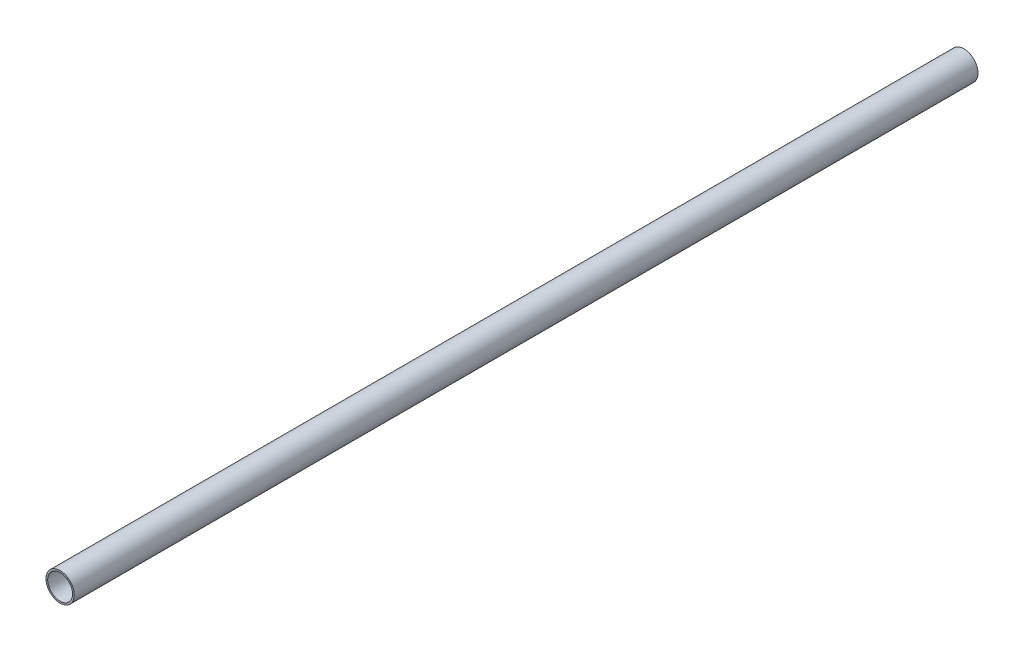
ISO-10303-21;
HEADER;
FILE_DESCRIPTION(('STEP AP214'),'2;1');
FILE_NAME('part.step','',(''),(''),'','','');
FILE_SCHEMA(('AUTOMOTIVE_DESIGN { 1 0 10303 214 1 1 1 1 }'));
ENDSEC;
DATA;
#1=APPLICATION_CONTEXT('core data for automotive mechanical design processes');
#2=APPLICATION_PROTOCOL_DEFINITION('international standard','automotive_design',2000,#1);
#3=PRODUCT_CONTEXT('',#1,'mechanical');
#4=PRODUCT('Part','Part','',(#3));
#5=PRODUCT_RELATED_PRODUCT_CATEGORY('part','',(#4));
#6=PRODUCT_DEFINITION_FORMATION('','',#4);
#7=PRODUCT_DEFINITION_CONTEXT('part definition',#1,'design');
#8=PRODUCT_DEFINITION('design','',#6,#7);
#9=PRODUCT_DEFINITION_SHAPE('','',#8);
#10=(LENGTH_UNIT() NAMED_UNIT(*) SI_UNIT(.MILLI.,.METRE.));
#11=(NAMED_UNIT(*) PLANE_ANGLE_UNIT() SI_UNIT($,.RADIAN.));
#12=(NAMED_UNIT(*) SI_UNIT($,.STERADIAN.) SOLID_ANGLE_UNIT());
#13=UNCERTAINTY_MEASURE_WITH_UNIT(LENGTH_MEASURE(1.E-05),#10,'distance_accuracy_value','');
#14=(GEOMETRIC_REPRESENTATION_CONTEXT(3) GLOBAL_UNCERTAINTY_ASSIGNED_CONTEXT((#13)) GLOBAL_UNIT_ASSIGNED_CONTEXT((#10,
#11,#12)) REPRESENTATION_CONTEXT('',''));
#15=CARTESIAN_POINT('',(0.,0.,0.));
#16=DIRECTION('',(0.,0.,1.));
#17=DIRECTION('',(1.,0.,0.));
#18=AXIS2_PLACEMENT_3D('',#15,#16,#17);
#19=CARTESIAN_POINT('',(0.,0.,800.));
#20=DIRECTION('',(0.,0.,1.));
#21=DIRECTION('',(1.,0.,0.));
#22=AXIS2_PLACEMENT_3D('',#19,#20,#21);
#23=PLANE('',#22);
#24=CARTESIAN_POINT('',(0.,0.,800.));
#25=DIRECTION('',(0.,0.,1.));
#26=DIRECTION('',(1.,0.,0.));
#27=AXIS2_PLACEMENT_3D('',#24,#25,#26);
#28=CIRCLE('',#27,12.5);
#29=CARTESIAN_POINT('',(12.5,0.,800.));
#30=VERTEX_POINT('',#29);
#31=EDGE_CURVE('E10',#30,#30,#28,.T.);
#32=ORIENTED_EDGE('',*,*,#31,.T.);
#33=EDGE_LOOP('',(#32));
#34=FACE_BOUND('',#33,.T.);
#35=CARTESIAN_POINT('',(0.,0.,800.));
#36=DIRECTION('',(0.,0.,1.));
#37=DIRECTION('',(1.,0.,0.));
#38=AXIS2_PLACEMENT_3D('',#35,#36,#37);
#39=CIRCLE('',#38,11.);
#40=CARTESIAN_POINT('',(11.,0.,800.));
#41=VERTEX_POINT('',#40);
#42=EDGE_CURVE('E50',#41,#41,#39,.T.);
#43=ORIENTED_EDGE('',*,*,#42,.F.);
#44=EDGE_LOOP('',(#43));
#45=FACE_BOUND('',#44,.T.);
#46=ADVANCED_FACE('F39',(#34,#45),#23,.T.);
#47=CARTESIAN_POINT('',(0.,0.,0.));
#48=DIRECTION('',(0.,0.,1.));
#49=DIRECTION('',(1.,0.,0.));
#50=AXIS2_PLACEMENT_3D('',#47,#48,#49);
#51=PLANE('',#50);
#52=CARTESIAN_POINT('',(0.,0.,0.));
#53=DIRECTION('',(0.,0.,1.));
#54=DIRECTION('',(1.,0.,0.));
#55=AXIS2_PLACEMENT_3D('',#52,#53,#54);
#56=CIRCLE('',#55,12.5);
#57=CARTESIAN_POINT('',(12.5,0.,0.));
#58=VERTEX_POINT('',#57);
#59=EDGE_CURVE('E43',#58,#58,#56,.T.);
#60=ORIENTED_EDGE('',*,*,#59,.F.);
#61=EDGE_LOOP('',(#60));
#62=FACE_BOUND('',#61,.T.);
#63=CARTESIAN_POINT('',(0.,0.,0.));
#64=DIRECTION('',(0.,0.,1.));
#65=DIRECTION('',(1.,0.,0.));
#66=AXIS2_PLACEMENT_3D('',#63,#64,#65);
#67=CIRCLE('',#66,11.);
#68=CARTESIAN_POINT('',(11.,0.,0.));
#69=VERTEX_POINT('',#68);
#70=EDGE_CURVE('E52',#69,#69,#67,.T.);
#71=ORIENTED_EDGE('',*,*,#70,.T.);
#72=EDGE_LOOP('',(#71));
#73=FACE_BOUND('',#72,.T.);
#74=ADVANCED_FACE('F62',(#62,#73),#51,.F.);
#75=CARTESIAN_POINT('',(0.,0.,800.));
#76=DIRECTION('',(0.,0.,-1.));
#77=DIRECTION('',(-1.,0.,0.));
#78=AXIS2_PLACEMENT_3D('',#75,#76,#77);
#79=CYLINDRICAL_SURFACE('',#78,12.5);
#80=ORIENTED_EDGE('',*,*,#31,.F.);
#81=EDGE_LOOP('',(#80));
#82=FACE_BOUND('',#81,.T.);
#83=ORIENTED_EDGE('',*,*,#59,.T.);
#84=EDGE_LOOP('',(#83));
#85=FACE_BOUND('',#84,.T.);
#86=ADVANCED_FACE('F41',(#82,#85),#79,.T.);
#87=CARTESIAN_POINT('',(0.,0.,800.));
#88=DIRECTION('',(0.,0.,-1.));
#89=DIRECTION('',(-1.,0.,0.));
#90=AXIS2_PLACEMENT_3D('',#87,#88,#89);
#91=CYLINDRICAL_SURFACE('',#90,11.);
#92=ORIENTED_EDGE('',*,*,#42,.T.);
#93=EDGE_LOOP('',(#92));
#94=FACE_BOUND('',#93,.T.);
#95=ORIENTED_EDGE('',*,*,#70,.F.);
#96=EDGE_LOOP('',(#95));
#97=FACE_BOUND('',#96,.T.);
#98=ADVANCED_FACE('F58',(#94,#97),#91,.F.);
#99=CLOSED_SHELL('',(#46,#74,#86,#98));
#100=MANIFOLD_SOLID_BREP('B2',#99);
#101=ADVANCED_BREP_SHAPE_REPRESENTATION('',(#18,#100),#14);
#102=SHAPE_DEFINITION_REPRESENTATION(#9,#101);
ENDSEC;
END-ISO-10303-21;
